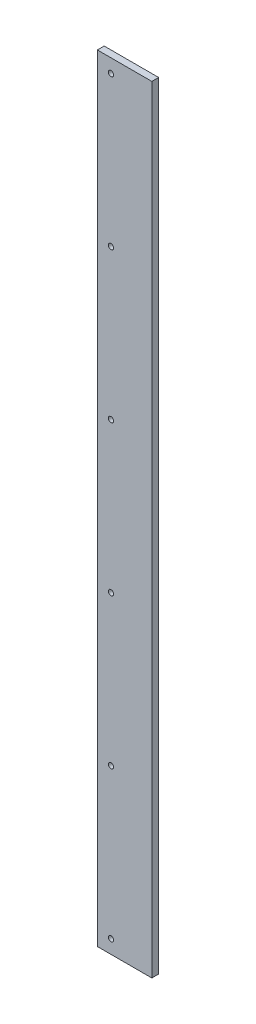
ISO-10303-21;
HEADER;
FILE_DESCRIPTION(('STEP AP214'),'2;1');
FILE_NAME('part.step','',(''),(''),'','','');
FILE_SCHEMA(('AUTOMOTIVE_DESIGN { 1 0 10303 214 1 1 1 1 }'));
ENDSEC;
DATA;
#1=APPLICATION_CONTEXT('core data for automotive mechanical design processes');
#2=APPLICATION_PROTOCOL_DEFINITION('international standard','automotive_design',2000,#1);
#3=PRODUCT_CONTEXT('',#1,'mechanical');
#4=PRODUCT('Part','Part','',(#3));
#5=PRODUCT_RELATED_PRODUCT_CATEGORY('part','',(#4));
#6=PRODUCT_DEFINITION_FORMATION('','',#4);
#7=PRODUCT_DEFINITION_CONTEXT('part definition',#1,'design');
#8=PRODUCT_DEFINITION('design','',#6,#7);
#9=PRODUCT_DEFINITION_SHAPE('','',#8);
#10=(LENGTH_UNIT() NAMED_UNIT(*) SI_UNIT(.MILLI.,.METRE.));
#11=(NAMED_UNIT(*) PLANE_ANGLE_UNIT() SI_UNIT($,.RADIAN.));
#12=(NAMED_UNIT(*) SI_UNIT($,.STERADIAN.) SOLID_ANGLE_UNIT());
#13=UNCERTAINTY_MEASURE_WITH_UNIT(LENGTH_MEASURE(1.E-05),#10,'distance_accuracy_value','');
#14=(GEOMETRIC_REPRESENTATION_CONTEXT(3) GLOBAL_UNCERTAINTY_ASSIGNED_CONTEXT((#13)) GLOBAL_UNIT_ASSIGNED_CONTEXT((#10,
#11,#12)) REPRESENTATION_CONTEXT('',''));
#15=CARTESIAN_POINT('',(0.,0.,0.));
#16=DIRECTION('',(0.,0.,1.));
#17=DIRECTION('',(1.,0.,0.));
#18=AXIS2_PLACEMENT_3D('',#15,#16,#17);
#19=CARTESIAN_POINT('',(0.,0.,6.35));
#20=DIRECTION('',(0.,0.,1.));
#21=DIRECTION('',(1.,0.,0.));
#22=AXIS2_PLACEMENT_3D('',#19,#20,#21);
#23=PLANE('',#22);
#24=CARTESIAN_POINT('',(-12.7,-349.25,6.35));
#25=DIRECTION('',(0.,0.,-1.));
#26=DIRECTION('',(-1.,0.,0.));
#27=AXIS2_PLACEMENT_3D('',#24,#25,#26);
#28=CIRCLE('',#27,2.4384);
#29=CARTESIAN_POINT('',(-15.1384,-349.25,6.35));
#30=VERTEX_POINT('',#29);
#31=EDGE_CURVE('E97',#30,#30,#28,.T.);
#32=ORIENTED_EDGE('',*,*,#31,.T.);
#33=EDGE_LOOP('',(#32));
#34=FACE_BOUND('',#33,.T.);
#35=CARTESIAN_POINT('',(-12.7,-209.55,6.35));
#36=DIRECTION('',(0.,0.,-1.));
#37=DIRECTION('',(-1.,0.,0.));
#38=AXIS2_PLACEMENT_3D('',#35,#36,#37);
#39=CIRCLE('',#38,2.4384);
#40=CARTESIAN_POINT('',(-15.1384,-209.55,6.35));
#41=VERTEX_POINT('',#40);
#42=EDGE_CURVE('E100',#41,#41,#39,.T.);
#43=ORIENTED_EDGE('',*,*,#42,.T.);
#44=EDGE_LOOP('',(#43));
#45=FACE_BOUND('',#44,.T.);
#46=CARTESIAN_POINT('',(-12.7,-69.85,6.35));
#47=DIRECTION('',(0.,0.,-1.));
#48=DIRECTION('',(-1.,0.,0.));
#49=AXIS2_PLACEMENT_3D('',#46,#47,#48);
#50=CIRCLE('',#49,2.4384);
#51=CARTESIAN_POINT('',(-15.1384,-69.85,6.35));
#52=VERTEX_POINT('',#51);
#53=EDGE_CURVE('E103',#52,#52,#50,.T.);
#54=ORIENTED_EDGE('',*,*,#53,.T.);
#55=EDGE_LOOP('',(#54));
#56=FACE_BOUND('',#55,.T.);
#57=CARTESIAN_POINT('',(-12.7,69.85,6.35));
#58=DIRECTION('',(0.,0.,-1.));
#59=DIRECTION('',(-1.,0.,0.));
#60=AXIS2_PLACEMENT_3D('',#57,#58,#59);
#61=CIRCLE('',#60,2.4384);
#62=CARTESIAN_POINT('',(-15.1384,69.85,6.35));
#63=VERTEX_POINT('',#62);
#64=EDGE_CURVE('E106',#63,#63,#61,.T.);
#65=ORIENTED_EDGE('',*,*,#64,.T.);
#66=EDGE_LOOP('',(#65));
#67=FACE_BOUND('',#66,.T.);
#68=CARTESIAN_POINT('',(-12.7,209.55,6.35));
#69=DIRECTION('',(0.,0.,-1.));
#70=DIRECTION('',(-1.,0.,0.));
#71=AXIS2_PLACEMENT_3D('',#68,#69,#70);
#72=CIRCLE('',#71,2.4384);
#73=CARTESIAN_POINT('',(-15.1384,209.55,6.35));
#74=VERTEX_POINT('',#73);
#75=EDGE_CURVE('E108',#74,#74,#72,.T.);
#76=ORIENTED_EDGE('',*,*,#75,.T.);
#77=EDGE_LOOP('',(#76));
#78=FACE_BOUND('',#77,.T.);
#79=CARTESIAN_POINT('',(-12.7,349.25,6.35));
#80=DIRECTION('',(0.,0.,-1.));
#81=DIRECTION('',(-1.,0.,0.));
#82=AXIS2_PLACEMENT_3D('',#79,#80,#81);
#83=CIRCLE('',#82,2.4384);
#84=CARTESIAN_POINT('',(-15.1384,349.25,6.35));
#85=VERTEX_POINT('',#84);
#86=EDGE_CURVE('E19',#85,#85,#83,.T.);
#87=ORIENTED_EDGE('',*,*,#86,.T.);
#88=EDGE_LOOP('',(#87));
#89=FACE_BOUND('',#88,.T.);
#90=DIRECTION('',(1.,0.,0.));
#91=VECTOR('',#90,1.);
#92=CARTESIAN_POINT('',(25.4,361.95,6.35));
#93=LINE('',#92,#91);
#94=CARTESIAN_POINT('',(-25.4,361.95,6.35));
#95=VERTEX_POINT('',#94);
#96=CARTESIAN_POINT('',(25.4,361.95,6.35));
#97=VERTEX_POINT('',#96);
#98=EDGE_CURVE('E70',#95,#97,#93,.T.);
#99=ORIENTED_EDGE('',*,*,#98,.F.);
#100=DIRECTION('',(0.,1.,0.));
#101=VECTOR('',#100,1.);
#102=CARTESIAN_POINT('',(-25.4,361.95,6.35));
#103=LINE('',#102,#101);
#104=CARTESIAN_POINT('',(-25.4,-361.95,6.35));
#105=VERTEX_POINT('',#104);
#106=EDGE_CURVE('E67',#105,#95,#103,.T.);
#107=ORIENTED_EDGE('',*,*,#106,.F.);
#108=DIRECTION('',(1.,0.,0.));
#109=VECTOR('',#108,1.);
#110=CARTESIAN_POINT('',(-25.4,-361.95,6.35));
#111=LINE('',#110,#109);
#112=CARTESIAN_POINT('',(25.4,-361.95,6.35));
#113=VERTEX_POINT('',#112);
#114=EDGE_CURVE('E58',#113,#105,#111,.F.);
#115=ORIENTED_EDGE('',*,*,#114,.F.);
#116=DIRECTION('',(0.,1.,0.));
#117=VECTOR('',#116,1.);
#118=CARTESIAN_POINT('',(25.4,-361.95,6.35));
#119=LINE('',#118,#117);
#120=EDGE_CURVE('E53',#97,#113,#119,.F.);
#121=ORIENTED_EDGE('',*,*,#120,.F.);
#122=EDGE_LOOP('',(#99,#107,#115,#121));
#123=FACE_BOUND('',#122,.T.);
#124=ADVANCED_FACE('F16',(#34,#45,#56,#67,#78,#89,#123),#23,.T.);
#125=CARTESIAN_POINT('',(-25.4,361.95,0.));
#126=DIRECTION('',(-1.,0.,0.));
#127=DIRECTION('',(0.,0.,1.));
#128=AXIS2_PLACEMENT_3D('',#125,#126,#127);
#129=PLANE('',#128);
#130=DIRECTION('',(0.,0.,1.));
#131=VECTOR('',#130,1.);
#132=CARTESIAN_POINT('',(-25.4,361.95,0.));
#133=LINE('',#132,#131);
#134=CARTESIAN_POINT('',(-25.4,361.95,0.));
#135=VERTEX_POINT('',#134);
#136=EDGE_CURVE('E116',#135,#95,#133,.T.);
#137=ORIENTED_EDGE('',*,*,#136,.F.);
#138=DIRECTION('',(0.,1.,0.));
#139=VECTOR('',#138,1.);
#140=CARTESIAN_POINT('',(-25.4,0.,0.));
#141=LINE('',#140,#139);
#142=CARTESIAN_POINT('',(-25.4,-361.95,0.));
#143=VERTEX_POINT('',#142);
#144=EDGE_CURVE('E77',#135,#143,#141,.F.);
#145=ORIENTED_EDGE('',*,*,#144,.T.);
#146=DIRECTION('',(0.,0.,-1.));
#147=VECTOR('',#146,1.);
#148=CARTESIAN_POINT('',(-25.4,-361.95,0.));
#149=LINE('',#148,#147);
#150=EDGE_CURVE('E63',#105,#143,#149,.T.);
#151=ORIENTED_EDGE('',*,*,#150,.F.);
#152=ORIENTED_EDGE('',*,*,#106,.T.);
#153=EDGE_LOOP('',(#137,#145,#151,#152));
#154=FACE_BOUND('',#153,.T.);
#155=ADVANCED_FACE('F76',(#154),#129,.T.);
#156=CARTESIAN_POINT('',(-25.4,-361.95,0.));
#157=DIRECTION('',(0.,-1.,0.));
#158=DIRECTION('',(0.,0.,-1.));
#159=AXIS2_PLACEMENT_3D('',#156,#157,#158);
#160=PLANE('',#159);
#161=ORIENTED_EDGE('',*,*,#150,.T.);
#162=DIRECTION('',(1.,0.,0.));
#163=VECTOR('',#162,1.);
#164=CARTESIAN_POINT('',(0.,-361.95,0.));
#165=LINE('',#164,#163);
#166=CARTESIAN_POINT('',(25.4,-361.95,0.));
#167=VERTEX_POINT('',#166);
#168=EDGE_CURVE('E127',#143,#167,#165,.T.);
#169=ORIENTED_EDGE('',*,*,#168,.T.);
#170=DIRECTION('',(0.,0.,-1.));
#171=VECTOR('',#170,1.);
#172=CARTESIAN_POINT('',(25.4,-361.95,0.));
#173=LINE('',#172,#171);
#174=EDGE_CURVE('E65',#113,#167,#173,.T.);
#175=ORIENTED_EDGE('',*,*,#174,.F.);
#176=ORIENTED_EDGE('',*,*,#114,.T.);
#177=EDGE_LOOP('',(#161,#169,#175,#176));
#178=FACE_BOUND('',#177,.T.);
#179=ADVANCED_FACE('F60',(#178),#160,.T.);
#180=CARTESIAN_POINT('',(25.4,-361.95,0.));
#181=DIRECTION('',(1.,0.,0.));
#182=DIRECTION('',(0.,0.,-1.));
#183=AXIS2_PLACEMENT_3D('',#180,#181,#182);
#184=PLANE('',#183);
#185=ORIENTED_EDGE('',*,*,#174,.T.);
#186=DIRECTION('',(0.,1.,0.));
#187=VECTOR('',#186,1.);
#188=CARTESIAN_POINT('',(25.4,0.,0.));
#189=LINE('',#188,#187);
#190=CARTESIAN_POINT('',(25.4,361.95,0.));
#191=VERTEX_POINT('',#190);
#192=EDGE_CURVE('E124',#167,#191,#189,.T.);
#193=ORIENTED_EDGE('',*,*,#192,.T.);
#194=DIRECTION('',(0.,0.,1.));
#195=VECTOR('',#194,1.);
#196=CARTESIAN_POINT('',(25.4,361.95,0.));
#197=LINE('',#196,#195);
#198=EDGE_CURVE('E34',#97,#191,#197,.F.);
#199=ORIENTED_EDGE('',*,*,#198,.F.);
#200=ORIENTED_EDGE('',*,*,#120,.T.);
#201=EDGE_LOOP('',(#185,#193,#199,#200));
#202=FACE_BOUND('',#201,.T.);
#203=ADVANCED_FACE('F123',(#202),#184,.T.);
#204=CARTESIAN_POINT('',(25.4,361.95,0.));
#205=DIRECTION('',(0.,1.,0.));
#206=DIRECTION('',(0.,0.,1.));
#207=AXIS2_PLACEMENT_3D('',#204,#205,#206);
#208=PLANE('',#207);
#209=ORIENTED_EDGE('',*,*,#198,.T.);
#210=DIRECTION('',(1.,0.,0.));
#211=VECTOR('',#210,1.);
#212=CARTESIAN_POINT('',(0.,361.95,0.));
#213=LINE('',#212,#211);
#214=EDGE_CURVE('E96',#191,#135,#213,.F.);
#215=ORIENTED_EDGE('',*,*,#214,.T.);
#216=ORIENTED_EDGE('',*,*,#136,.T.);
#217=ORIENTED_EDGE('',*,*,#98,.T.);
#218=EDGE_LOOP('',(#209,#215,#216,#217));
#219=FACE_BOUND('',#218,.T.);
#220=ADVANCED_FACE('F130',(#219),#208,.T.);
#221=CARTESIAN_POINT('',(-12.7,349.25,6.35));
#222=DIRECTION('',(0.,0.,-1.));
#223=DIRECTION('',(-1.,0.,0.));
#224=AXIS2_PLACEMENT_3D('',#221,#222,#223);
#225=CYLINDRICAL_SURFACE('',#224,2.4384);
#226=ORIENTED_EDGE('',*,*,#86,.F.);
#227=EDGE_LOOP('',(#226));
#228=FACE_BOUND('',#227,.T.);
#229=CARTESIAN_POINT('',(-12.7,349.25,0.));
#230=DIRECTION('',(0.,0.,-1.));
#231=DIRECTION('',(-1.,0.,0.));
#232=AXIS2_PLACEMENT_3D('',#229,#230,#231);
#233=CIRCLE('',#232,2.4384);
#234=CARTESIAN_POINT('',(-15.1384,349.25,0.));
#235=VERTEX_POINT('',#234);
#236=EDGE_CURVE('E93',#235,#235,#233,.T.);
#237=ORIENTED_EDGE('',*,*,#236,.T.);
#238=EDGE_LOOP('',(#237));
#239=FACE_BOUND('',#238,.T.);
#240=ADVANCED_FACE('F132',(#228,#239),#225,.F.);
#241=CARTESIAN_POINT('',(-12.7,209.55,6.35));
#242=DIRECTION('',(0.,0.,-1.));
#243=DIRECTION('',(-1.,0.,0.));
#244=AXIS2_PLACEMENT_3D('',#241,#242,#243);
#245=CYLINDRICAL_SURFACE('',#244,2.4384);
#246=ORIENTED_EDGE('',*,*,#75,.F.);
#247=EDGE_LOOP('',(#246));
#248=FACE_BOUND('',#247,.T.);
#249=CARTESIAN_POINT('',(-12.7,209.55,0.));
#250=DIRECTION('',(0.,0.,-1.));
#251=DIRECTION('',(-1.,0.,0.));
#252=AXIS2_PLACEMENT_3D('',#249,#250,#251);
#253=CIRCLE('',#252,2.4384);
#254=CARTESIAN_POINT('',(-15.1384,209.55,0.));
#255=VERTEX_POINT('',#254);
#256=EDGE_CURVE('E90',#255,#255,#253,.T.);
#257=ORIENTED_EDGE('',*,*,#256,.T.);
#258=EDGE_LOOP('',(#257));
#259=FACE_BOUND('',#258,.T.);
#260=ADVANCED_FACE('F139',(#248,#259),#245,.F.);
#261=CARTESIAN_POINT('',(-12.7,69.85,6.35));
#262=DIRECTION('',(0.,0.,-1.));
#263=DIRECTION('',(-1.,0.,0.));
#264=AXIS2_PLACEMENT_3D('',#261,#262,#263);
#265=CYLINDRICAL_SURFACE('',#264,2.4384);
#266=ORIENTED_EDGE('',*,*,#64,.F.);
#267=EDGE_LOOP('',(#266));
#268=FACE_BOUND('',#267,.T.);
#269=CARTESIAN_POINT('',(-12.7,69.85,0.));
#270=DIRECTION('',(0.,0.,-1.));
#271=DIRECTION('',(-1.,0.,0.));
#272=AXIS2_PLACEMENT_3D('',#269,#270,#271);
#273=CIRCLE('',#272,2.4384);
#274=CARTESIAN_POINT('',(-15.1384,69.85,0.));
#275=VERTEX_POINT('',#274);
#276=EDGE_CURVE('E87',#275,#275,#273,.T.);
#277=ORIENTED_EDGE('',*,*,#276,.T.);
#278=EDGE_LOOP('',(#277));
#279=FACE_BOUND('',#278,.T.);
#280=ADVANCED_FACE('F162',(#268,#279),#265,.F.);
#281=CARTESIAN_POINT('',(-12.7,-69.85,6.35));
#282=DIRECTION('',(0.,0.,-1.));
#283=DIRECTION('',(-1.,0.,0.));
#284=AXIS2_PLACEMENT_3D('',#281,#282,#283);
#285=CYLINDRICAL_SURFACE('',#284,2.4384);
#286=ORIENTED_EDGE('',*,*,#53,.F.);
#287=EDGE_LOOP('',(#286));
#288=FACE_BOUND('',#287,.T.);
#289=CARTESIAN_POINT('',(-12.7,-69.85,0.));
#290=DIRECTION('',(0.,0.,-1.));
#291=DIRECTION('',(-1.,0.,0.));
#292=AXIS2_PLACEMENT_3D('',#289,#290,#291);
#293=CIRCLE('',#292,2.4384);
#294=CARTESIAN_POINT('',(-15.1384,-69.85,0.));
#295=VERTEX_POINT('',#294);
#296=EDGE_CURVE('E84',#295,#295,#293,.T.);
#297=ORIENTED_EDGE('',*,*,#296,.T.);
#298=EDGE_LOOP('',(#297));
#299=FACE_BOUND('',#298,.T.);
#300=ADVANCED_FACE('F158',(#288,#299),#285,.F.);
#301=CARTESIAN_POINT('',(-12.7,-209.55,6.35));
#302=DIRECTION('',(0.,0.,-1.));
#303=DIRECTION('',(-1.,0.,0.));
#304=AXIS2_PLACEMENT_3D('',#301,#302,#303);
#305=CYLINDRICAL_SURFACE('',#304,2.4384);
#306=ORIENTED_EDGE('',*,*,#42,.F.);
#307=EDGE_LOOP('',(#306));
#308=FACE_BOUND('',#307,.T.);
#309=CARTESIAN_POINT('',(-12.7,-209.55,0.));
#310=DIRECTION('',(0.,0.,-1.));
#311=DIRECTION('',(-1.,0.,0.));
#312=AXIS2_PLACEMENT_3D('',#309,#310,#311);
#313=CIRCLE('',#312,2.4384);
#314=CARTESIAN_POINT('',(-15.1384,-209.55,0.));
#315=VERTEX_POINT('',#314);
#316=EDGE_CURVE('E25',#315,#315,#313,.T.);
#317=ORIENTED_EDGE('',*,*,#316,.T.);
#318=EDGE_LOOP('',(#317));
#319=FACE_BOUND('',#318,.T.);
#320=ADVANCED_FACE('F150',(#308,#319),#305,.F.);
#321=CARTESIAN_POINT('',(-12.7,-349.25,6.35));
#322=DIRECTION('',(0.,0.,-1.));
#323=DIRECTION('',(-1.,0.,0.));
#324=AXIS2_PLACEMENT_3D('',#321,#322,#323);
#325=CYLINDRICAL_SURFACE('',#324,2.4384);
#326=ORIENTED_EDGE('',*,*,#31,.F.);
#327=EDGE_LOOP('',(#326));
#328=FACE_BOUND('',#327,.T.);
#329=CARTESIAN_POINT('',(-12.7,-349.25,0.));
#330=DIRECTION('',(0.,0.,-1.));
#331=DIRECTION('',(-1.,0.,0.));
#332=AXIS2_PLACEMENT_3D('',#329,#330,#331);
#333=CIRCLE('',#332,2.4384);
#334=CARTESIAN_POINT('',(-15.1384,-349.25,0.));
#335=VERTEX_POINT('',#334);
#336=EDGE_CURVE('E11',#335,#335,#333,.T.);
#337=ORIENTED_EDGE('',*,*,#336,.T.);
#338=EDGE_LOOP('',(#337));
#339=FACE_BOUND('',#338,.T.);
#340=ADVANCED_FACE('F144',(#328,#339),#325,.F.);
#341=CARTESIAN_POINT('',(0.,0.,0.));
#342=DIRECTION('',(0.,0.,1.));
#343=DIRECTION('',(1.,0.,0.));
#344=AXIS2_PLACEMENT_3D('',#341,#342,#343);
#345=PLANE('',#344);
#346=ORIENTED_EDGE('',*,*,#336,.F.);
#347=EDGE_LOOP('',(#346));
#348=FACE_BOUND('',#347,.T.);
#349=ORIENTED_EDGE('',*,*,#316,.F.);
#350=EDGE_LOOP('',(#349));
#351=FACE_BOUND('',#350,.T.);
#352=ORIENTED_EDGE('',*,*,#296,.F.);
#353=EDGE_LOOP('',(#352));
#354=FACE_BOUND('',#353,.T.);
#355=ORIENTED_EDGE('',*,*,#276,.F.);
#356=EDGE_LOOP('',(#355));
#357=FACE_BOUND('',#356,.T.);
#358=ORIENTED_EDGE('',*,*,#256,.F.);
#359=EDGE_LOOP('',(#358));
#360=FACE_BOUND('',#359,.T.);
#361=ORIENTED_EDGE('',*,*,#236,.F.);
#362=EDGE_LOOP('',(#361));
#363=FACE_BOUND('',#362,.T.);
#364=ORIENTED_EDGE('',*,*,#192,.F.);
#365=ORIENTED_EDGE('',*,*,#168,.F.);
#366=ORIENTED_EDGE('',*,*,#144,.F.);
#367=ORIENTED_EDGE('',*,*,#214,.F.);
#368=EDGE_LOOP('',(#364,#365,#366,#367));
#369=FACE_BOUND('',#368,.T.);
#370=ADVANCED_FACE('F126',(#348,#351,#354,#357,#360,#363,#369),#345,.F.);
#371=CLOSED_SHELL('',(#124,#155,#179,#203,#220,#240,#260,#280,#300,#320,#340,#370));
#372=MANIFOLD_SOLID_BREP('B1',#371);
#373=ADVANCED_BREP_SHAPE_REPRESENTATION('',(#18,#372),#14);
#374=SHAPE_DEFINITION_REPRESENTATION(#9,#373);
ENDSEC;
END-ISO-10303-21;
